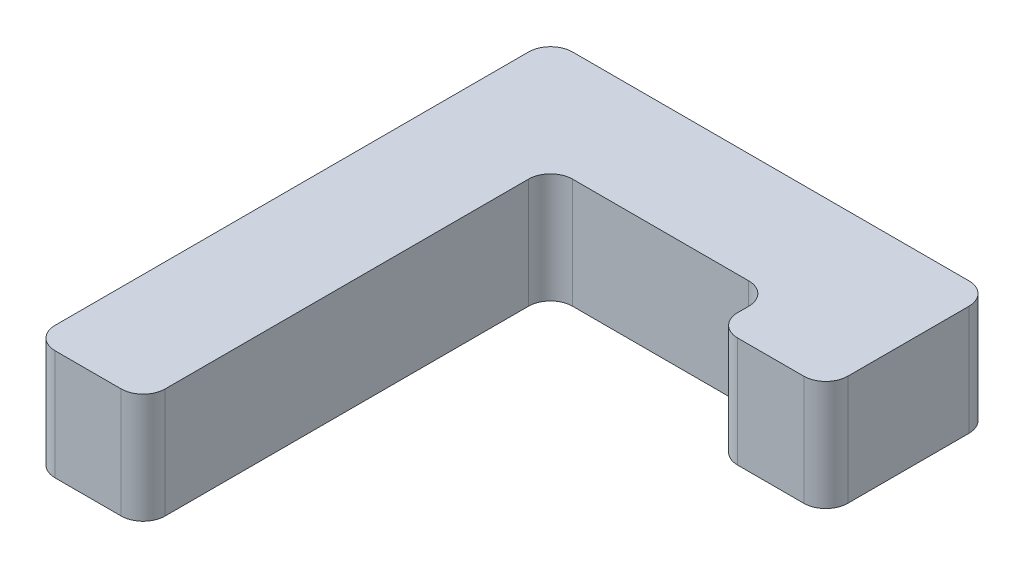
ISO-10303-21;
HEADER;
FILE_DESCRIPTION(('STEP AP214'),'2;1');
FILE_NAME('part.step','',(''),(''),'','','');
FILE_SCHEMA(('AUTOMOTIVE_DESIGN { 1 0 10303 214 1 1 1 1 }'));
ENDSEC;
DATA;
#1=APPLICATION_CONTEXT('core data for automotive mechanical design processes');
#2=APPLICATION_PROTOCOL_DEFINITION('international standard','automotive_design',2000,#1);
#3=PRODUCT_CONTEXT('',#1,'mechanical');
#4=PRODUCT('Part','Part','',(#3));
#5=PRODUCT_RELATED_PRODUCT_CATEGORY('part','',(#4));
#6=PRODUCT_DEFINITION_FORMATION('','',#4);
#7=PRODUCT_DEFINITION_CONTEXT('part definition',#1,'design');
#8=PRODUCT_DEFINITION('design','',#6,#7);
#9=PRODUCT_DEFINITION_SHAPE('','',#8);
#10=(LENGTH_UNIT() NAMED_UNIT(*) SI_UNIT(.MILLI.,.METRE.));
#11=(NAMED_UNIT(*) PLANE_ANGLE_UNIT() SI_UNIT($,.RADIAN.));
#12=(NAMED_UNIT(*) SI_UNIT($,.STERADIAN.) SOLID_ANGLE_UNIT());
#13=UNCERTAINTY_MEASURE_WITH_UNIT(LENGTH_MEASURE(1.E-05),#10,'distance_accuracy_value','');
#14=(GEOMETRIC_REPRESENTATION_CONTEXT(3) GLOBAL_UNCERTAINTY_ASSIGNED_CONTEXT((#13)) GLOBAL_UNIT_ASSIGNED_CONTEXT((#10,
#11,#12)) REPRESENTATION_CONTEXT('',''));
#15=CARTESIAN_POINT('',(0.,0.,0.));
#16=DIRECTION('',(0.,0.,1.));
#17=DIRECTION('',(1.,0.,0.));
#18=AXIS2_PLACEMENT_3D('',#15,#16,#17);
#19=CARTESIAN_POINT('',(12.7,12.7,0.));
#20=DIRECTION('',(0.,0.,-1.));
#21=DIRECTION('',(-1.,0.,0.));
#22=AXIS2_PLACEMENT_3D('',#19,#20,#21);
#23=PLANE('',#22);
#24=DIRECTION('',(1.,0.,0.));
#25=VECTOR('',#24,1.);
#26=CARTESIAN_POINT('',(12.7,0.,0.));
#27=LINE('',#26,#25);
#28=CARTESIAN_POINT('',(2.54,0.,0.));
#29=VERTEX_POINT('',#28);
#30=CARTESIAN_POINT('',(10.16,0.,0.));
#31=VERTEX_POINT('',#30);
#32=EDGE_CURVE('E257',#29,#31,#27,.T.);
#33=ORIENTED_EDGE('',*,*,#32,.T.);
#34=DIRECTION('',(0.,-1.,0.));
#35=VECTOR('',#34,1.);
#36=CARTESIAN_POINT('',(10.16,12.7,0.));
#37=LINE('',#36,#35);
#38=CARTESIAN_POINT('',(10.16,12.7,0.));
#39=VERTEX_POINT('',#38);
#40=EDGE_CURVE('E234',#31,#39,#37,.F.);
#41=ORIENTED_EDGE('',*,*,#40,.T.);
#42=DIRECTION('',(1.,0.,0.));
#43=VECTOR('',#42,1.);
#44=CARTESIAN_POINT('',(12.7,12.7,0.));
#45=LINE('',#44,#43);
#46=CARTESIAN_POINT('',(2.54,12.7,0.));
#47=VERTEX_POINT('',#46);
#48=EDGE_CURVE('E181',#47,#39,#45,.T.);
#49=ORIENTED_EDGE('',*,*,#48,.F.);
#50=DIRECTION('',(0.,-1.,0.));
#51=VECTOR('',#50,1.);
#52=CARTESIAN_POINT('',(2.54,12.7,0.));
#53=LINE('',#52,#51);
#54=EDGE_CURVE('E231',#47,#29,#53,.T.);
#55=ORIENTED_EDGE('',*,*,#54,.T.);
#56=EDGE_LOOP('',(#33,#41,#49,#55));
#57=FACE_BOUND('',#56,.T.);
#58=ADVANCED_FACE('F39',(#57),#23,.F.);
#59=CARTESIAN_POINT('',(12.7,12.7,-46.99));
#60=DIRECTION('',(-1.,0.,0.));
#61=DIRECTION('',(0.,0.,1.));
#62=AXIS2_PLACEMENT_3D('',#59,#60,#61);
#63=PLANE('',#62);
#64=DIRECTION('',(0.,0.,-1.));
#65=VECTOR('',#64,1.);
#66=CARTESIAN_POINT('',(12.7,12.7,-46.99));
#67=LINE('',#66,#65);
#68=CARTESIAN_POINT('',(12.7,12.7,-2.54));
#69=VERTEX_POINT('',#68);
#70=CARTESIAN_POINT('',(12.7,12.7,-44.45));
#71=VERTEX_POINT('',#70);
#72=EDGE_CURVE('E267',#69,#71,#67,.T.);
#73=ORIENTED_EDGE('',*,*,#72,.F.);
#74=DIRECTION('',(0.,-1.,0.));
#75=VECTOR('',#74,1.);
#76=CARTESIAN_POINT('',(12.7,12.7,-2.54));
#77=LINE('',#76,#75);
#78=CARTESIAN_POINT('',(12.7,0.,-2.54));
#79=VERTEX_POINT('',#78);
#80=EDGE_CURVE('E228',#69,#79,#77,.T.);
#81=ORIENTED_EDGE('',*,*,#80,.T.);
#82=DIRECTION('',(0.,0.,-1.));
#83=VECTOR('',#82,1.);
#84=CARTESIAN_POINT('',(12.7,0.,-46.99));
#85=LINE('',#84,#83);
#86=CARTESIAN_POINT('',(12.7,0.,-44.45));
#87=VERTEX_POINT('',#86);
#88=EDGE_CURVE('E246',#79,#87,#85,.T.);
#89=ORIENTED_EDGE('',*,*,#88,.T.);
#90=DIRECTION('',(0.,-1.,0.));
#91=VECTOR('',#90,1.);
#92=CARTESIAN_POINT('',(12.7,12.7,-44.45));
#93=LINE('',#92,#91);
#94=EDGE_CURVE('E226',#87,#71,#93,.F.);
#95=ORIENTED_EDGE('',*,*,#94,.T.);
#96=EDGE_LOOP('',(#73,#81,#89,#95));
#97=FACE_BOUND('',#96,.T.);
#98=ADVANCED_FACE('F254',(#97),#63,.F.);
#99=CARTESIAN_POINT('',(38.1,12.7,-46.99));
#100=DIRECTION('',(0.,0.,-1.));
#101=DIRECTION('',(-1.,0.,0.));
#102=AXIS2_PLACEMENT_3D('',#99,#100,#101);
#103=PLANE('',#102);
#104=DIRECTION('',(1.,0.,0.));
#105=VECTOR('',#104,1.);
#106=CARTESIAN_POINT('',(38.1,0.,-46.99));
#107=LINE('',#106,#105);
#108=CARTESIAN_POINT('',(15.24,0.,-46.99));
#109=VERTEX_POINT('',#108);
#110=CARTESIAN_POINT('',(35.56,0.,-46.99));
#111=VERTEX_POINT('',#110);
#112=EDGE_CURVE('E248',#109,#111,#107,.T.);
#113=ORIENTED_EDGE('',*,*,#112,.T.);
#114=DIRECTION('',(0.,-1.,0.));
#115=VECTOR('',#114,1.);
#116=CARTESIAN_POINT('',(35.56,12.7,-46.99));
#117=LINE('',#116,#115);
#118=CARTESIAN_POINT('',(35.56,12.7,-46.99));
#119=VERTEX_POINT('',#118);
#120=EDGE_CURVE('E219',#111,#119,#117,.F.);
#121=ORIENTED_EDGE('',*,*,#120,.T.);
#122=DIRECTION('',(1.,0.,0.));
#123=VECTOR('',#122,1.);
#124=CARTESIAN_POINT('',(38.1,12.7,-46.99));
#125=LINE('',#124,#123);
#126=CARTESIAN_POINT('',(15.24,12.7,-46.99));
#127=VERTEX_POINT('',#126);
#128=EDGE_CURVE('E265',#127,#119,#125,.T.);
#129=ORIENTED_EDGE('',*,*,#128,.F.);
#130=DIRECTION('',(0.,-1.,0.));
#131=VECTOR('',#130,1.);
#132=CARTESIAN_POINT('',(15.24,0.,-46.99));
#133=LINE('',#132,#131);
#134=EDGE_CURVE('E216',#127,#109,#133,.T.);
#135=ORIENTED_EDGE('',*,*,#134,.T.);
#136=EDGE_LOOP('',(#113,#121,#129,#135));
#137=FACE_BOUND('',#136,.T.);
#138=ADVANCED_FACE('F269',(#137),#103,.F.);
#139=CARTESIAN_POINT('',(38.1,12.7,-40.64));
#140=DIRECTION('',(1.,0.,0.));
#141=DIRECTION('',(0.,0.,-1.));
#142=AXIS2_PLACEMENT_3D('',#139,#140,#141);
#143=PLANE('',#142);
#144=DIRECTION('',(0.,0.,1.));
#145=VECTOR('',#144,1.);
#146=CARTESIAN_POINT('',(38.1,12.7,-40.64));
#147=LINE('',#146,#145);
#148=CARTESIAN_POINT('',(38.1,12.7,-44.45));
#149=VERTEX_POINT('',#148);
#150=CARTESIAN_POINT('',(38.1,12.7,-43.18));
#151=VERTEX_POINT('',#150);
#152=EDGE_CURVE('E271',#149,#151,#147,.T.);
#153=ORIENTED_EDGE('',*,*,#152,.F.);
#154=DIRECTION('',(0.,-1.,0.));
#155=VECTOR('',#154,1.);
#156=CARTESIAN_POINT('',(38.1,0.,-44.45));
#157=LINE('',#156,#155);
#158=CARTESIAN_POINT('',(38.1,0.,-44.45));
#159=VERTEX_POINT('',#158);
#160=EDGE_CURVE('E213',#149,#159,#157,.T.);
#161=ORIENTED_EDGE('',*,*,#160,.T.);
#162=DIRECTION('',(0.,0.,1.));
#163=VECTOR('',#162,1.);
#164=CARTESIAN_POINT('',(38.1,0.,-40.64));
#165=LINE('',#164,#163);
#166=CARTESIAN_POINT('',(38.1,0.,-43.18));
#167=VERTEX_POINT('',#166);
#168=EDGE_CURVE('E288',#159,#167,#165,.T.);
#169=ORIENTED_EDGE('',*,*,#168,.T.);
#170=DIRECTION('',(0.,-1.,0.));
#171=VECTOR('',#170,1.);
#172=CARTESIAN_POINT('',(38.1,12.7,-43.18));
#173=LINE('',#172,#171);
#174=EDGE_CURVE('E211',#167,#151,#173,.F.);
#175=ORIENTED_EDGE('',*,*,#174,.T.);
#176=EDGE_LOOP('',(#153,#161,#169,#175));
#177=FACE_BOUND('',#176,.T.);
#178=ADVANCED_FACE('F312',(#177),#143,.F.);
#179=CARTESIAN_POINT('',(50.8,12.7,-40.64));
#180=DIRECTION('',(0.,0.,-1.));
#181=DIRECTION('',(-1.,0.,0.));
#182=AXIS2_PLACEMENT_3D('',#179,#180,#181);
#183=PLANE('',#182);
#184=DIRECTION('',(1.,0.,0.));
#185=VECTOR('',#184,1.);
#186=CARTESIAN_POINT('',(50.8,0.,-40.64));
#187=LINE('',#186,#185);
#188=CARTESIAN_POINT('',(40.64,0.,-40.64));
#189=VERTEX_POINT('',#188);
#190=CARTESIAN_POINT('',(48.26,0.,-40.64));
#191=VERTEX_POINT('',#190);
#192=EDGE_CURVE('E183',#189,#191,#187,.T.);
#193=ORIENTED_EDGE('',*,*,#192,.T.);
#194=DIRECTION('',(0.,-1.,0.));
#195=VECTOR('',#194,1.);
#196=CARTESIAN_POINT('',(48.26,12.7,-40.64));
#197=LINE('',#196,#195);
#198=CARTESIAN_POINT('',(48.26,12.7,-40.64));
#199=VERTEX_POINT('',#198);
#200=EDGE_CURVE('E224',#191,#199,#197,.F.);
#201=ORIENTED_EDGE('',*,*,#200,.T.);
#202=DIRECTION('',(1.,0.,0.));
#203=VECTOR('',#202,1.);
#204=CARTESIAN_POINT('',(50.8,12.7,-40.64));
#205=LINE('',#204,#203);
#206=CARTESIAN_POINT('',(40.64,12.7,-40.64));
#207=VERTEX_POINT('',#206);
#208=EDGE_CURVE('E274',#207,#199,#205,.T.);
#209=ORIENTED_EDGE('',*,*,#208,.F.);
#210=DIRECTION('',(0.,-1.,0.));
#211=VECTOR('',#210,1.);
#212=CARTESIAN_POINT('',(40.64,12.7,-40.64));
#213=LINE('',#212,#211);
#214=EDGE_CURVE('E221',#207,#189,#213,.T.);
#215=ORIENTED_EDGE('',*,*,#214,.T.);
#216=EDGE_LOOP('',(#193,#201,#209,#215));
#217=FACE_BOUND('',#216,.T.);
#218=ADVANCED_FACE('F294',(#217),#183,.F.);
#219=CARTESIAN_POINT('',(50.8,12.7,-59.69));
#220=DIRECTION('',(-1.,0.,0.));
#221=DIRECTION('',(0.,0.,1.));
#222=AXIS2_PLACEMENT_3D('',#219,#220,#221);
#223=PLANE('',#222);
#224=DIRECTION('',(0.,0.,-1.));
#225=VECTOR('',#224,1.);
#226=CARTESIAN_POINT('',(50.8,0.,-59.69));
#227=LINE('',#226,#225);
#228=CARTESIAN_POINT('',(50.8,0.,-43.18));
#229=VERTEX_POINT('',#228);
#230=CARTESIAN_POINT('',(50.8,0.,-57.15));
#231=VERTEX_POINT('',#230);
#232=EDGE_CURVE('E179',#229,#231,#227,.T.);
#233=ORIENTED_EDGE('',*,*,#232,.T.);
#234=DIRECTION('',(0.,-1.,0.));
#235=VECTOR('',#234,1.);
#236=CARTESIAN_POINT('',(50.8,12.7,-57.15));
#237=LINE('',#236,#235);
#238=CARTESIAN_POINT('',(50.8,12.7,-57.15));
#239=VERTEX_POINT('',#238);
#240=EDGE_CURVE('E158',#231,#239,#237,.F.);
#241=ORIENTED_EDGE('',*,*,#240,.T.);
#242=DIRECTION('',(0.,0.,-1.));
#243=VECTOR('',#242,1.);
#244=CARTESIAN_POINT('',(50.8,12.7,-59.69));
#245=LINE('',#244,#243);
#246=CARTESIAN_POINT('',(50.8,12.7,-43.18));
#247=VERTEX_POINT('',#246);
#248=EDGE_CURVE('E281',#247,#239,#245,.T.);
#249=ORIENTED_EDGE('',*,*,#248,.F.);
#250=DIRECTION('',(0.,-1.,0.));
#251=VECTOR('',#250,1.);
#252=CARTESIAN_POINT('',(50.8,12.7,-43.18));
#253=LINE('',#252,#251);
#254=EDGE_CURVE('E163',#247,#229,#253,.T.);
#255=ORIENTED_EDGE('',*,*,#254,.T.);
#256=EDGE_LOOP('',(#233,#241,#249,#255));
#257=FACE_BOUND('',#256,.T.);
#258=ADVANCED_FACE('F303',(#257),#223,.F.);
#259=CARTESIAN_POINT('',(0.,12.7,-59.69));
#260=DIRECTION('',(0.,0.,1.));
#261=DIRECTION('',(1.,0.,0.));
#262=AXIS2_PLACEMENT_3D('',#259,#260,#261);
#263=PLANE('',#262);
#264=DIRECTION('',(-1.,0.,0.));
#265=VECTOR('',#264,1.);
#266=CARTESIAN_POINT('',(0.,12.7,-59.69));
#267=LINE('',#266,#265);
#268=CARTESIAN_POINT('',(48.26,12.7,-59.69));
#269=VERTEX_POINT('',#268);
#270=CARTESIAN_POINT('',(2.54,12.7,-59.69));
#271=VERTEX_POINT('',#270);
#272=EDGE_CURVE('E172',#269,#271,#267,.T.);
#273=ORIENTED_EDGE('',*,*,#272,.F.);
#274=DIRECTION('',(0.,-1.,0.));
#275=VECTOR('',#274,1.);
#276=CARTESIAN_POINT('',(48.26,12.7,-59.69));
#277=LINE('',#276,#275);
#278=CARTESIAN_POINT('',(48.26,0.,-59.69));
#279=VERTEX_POINT('',#278);
#280=EDGE_CURVE('E157',#269,#279,#277,.T.);
#281=ORIENTED_EDGE('',*,*,#280,.T.);
#282=DIRECTION('',(-1.,0.,0.));
#283=VECTOR('',#282,1.);
#284=CARTESIAN_POINT('',(0.,0.,-59.69));
#285=LINE('',#284,#283);
#286=CARTESIAN_POINT('',(2.54,0.,-59.69));
#287=VERTEX_POINT('',#286);
#288=EDGE_CURVE('E170',#279,#287,#285,.T.);
#289=ORIENTED_EDGE('',*,*,#288,.T.);
#290=DIRECTION('',(0.,-1.,0.));
#291=VECTOR('',#290,1.);
#292=CARTESIAN_POINT('',(2.54,12.7,-59.69));
#293=LINE('',#292,#291);
#294=EDGE_CURVE('E174',#287,#271,#293,.F.);
#295=ORIENTED_EDGE('',*,*,#294,.T.);
#296=EDGE_LOOP('',(#273,#281,#289,#295));
#297=FACE_BOUND('',#296,.T.);
#298=ADVANCED_FACE('F169',(#297),#263,.F.);
#299=CARTESIAN_POINT('',(0.,12.7,0.));
#300=DIRECTION('',(1.,0.,0.));
#301=DIRECTION('',(0.,0.,-1.));
#302=AXIS2_PLACEMENT_3D('',#299,#300,#301);
#303=PLANE('',#302);
#304=DIRECTION('',(0.,0.,1.));
#305=VECTOR('',#304,1.);
#306=CARTESIAN_POINT('',(0.,0.,0.));
#307=LINE('',#306,#305);
#308=CARTESIAN_POINT('',(0.,0.,-57.15));
#309=VERTEX_POINT('',#308);
#310=CARTESIAN_POINT('',(0.,0.,-2.54));
#311=VERTEX_POINT('',#310);
#312=EDGE_CURVE('E178',#309,#311,#307,.T.);
#313=ORIENTED_EDGE('',*,*,#312,.T.);
#314=DIRECTION('',(0.,-1.,0.));
#315=VECTOR('',#314,1.);
#316=CARTESIAN_POINT('',(0.,12.7,-2.54));
#317=LINE('',#316,#315);
#318=CARTESIAN_POINT('',(0.,12.7,-2.54));
#319=VERTEX_POINT('',#318);
#320=EDGE_CURVE('E54',#311,#319,#317,.F.);
#321=ORIENTED_EDGE('',*,*,#320,.T.);
#322=DIRECTION('',(0.,0.,1.));
#323=VECTOR('',#322,1.);
#324=CARTESIAN_POINT('',(0.,12.7,0.));
#325=LINE('',#324,#323);
#326=CARTESIAN_POINT('',(0.,12.7,-57.15));
#327=VERTEX_POINT('',#326);
#328=EDGE_CURVE('E187',#327,#319,#325,.T.);
#329=ORIENTED_EDGE('',*,*,#328,.F.);
#330=DIRECTION('',(0.,-1.,0.));
#331=VECTOR('',#330,1.);
#332=CARTESIAN_POINT('',(0.,12.7,-57.15));
#333=LINE('',#332,#331);
#334=EDGE_CURVE('E236',#327,#309,#333,.T.);
#335=ORIENTED_EDGE('',*,*,#334,.T.);
#336=EDGE_LOOP('',(#313,#321,#329,#335));
#337=FACE_BOUND('',#336,.T.);
#338=ADVANCED_FACE('F310',(#337),#303,.F.);
#339=CARTESIAN_POINT('',(0.,12.7,0.));
#340=DIRECTION('',(0.,-1.,0.));
#341=DIRECTION('',(0.,0.,-1.));
#342=AXIS2_PLACEMENT_3D('',#339,#340,#341);
#343=PLANE('',#342);
#344=ORIENTED_EDGE('',*,*,#248,.T.);
#345=CARTESIAN_POINT('',(48.26,12.7,-57.15));
#346=DIRECTION('',(0.,-1.,0.));
#347=DIRECTION('',(0.,0.,-1.));
#348=AXIS2_PLACEMENT_3D('',#345,#346,#347);
#349=CIRCLE('',#348,2.54);
#350=EDGE_CURVE('E209',#239,#269,#349,.F.);
#351=ORIENTED_EDGE('',*,*,#350,.T.);
#352=ORIENTED_EDGE('',*,*,#272,.T.);
#353=CARTESIAN_POINT('',(2.54,12.7,-57.15));
#354=DIRECTION('',(0.,-1.,0.));
#355=DIRECTION('',(0.,0.,-1.));
#356=AXIS2_PLACEMENT_3D('',#353,#354,#355);
#357=CIRCLE('',#356,2.54);
#358=EDGE_CURVE('E61',#271,#327,#357,.F.);
#359=ORIENTED_EDGE('',*,*,#358,.T.);
#360=ORIENTED_EDGE('',*,*,#328,.T.);
#361=CARTESIAN_POINT('',(2.54,12.7,-2.54));
#362=DIRECTION('',(0.,-1.,0.));
#363=DIRECTION('',(0.,0.,-1.));
#364=AXIS2_PLACEMENT_3D('',#361,#362,#363);
#365=CIRCLE('',#364,2.54);
#366=EDGE_CURVE('E201',#319,#47,#365,.F.);
#367=ORIENTED_EDGE('',*,*,#366,.T.);
#368=ORIENTED_EDGE('',*,*,#48,.T.);
#369=CARTESIAN_POINT('',(10.16,12.7,-2.54));
#370=DIRECTION('',(0.,-1.,0.));
#371=DIRECTION('',(0.,0.,-1.));
#372=AXIS2_PLACEMENT_3D('',#369,#370,#371);
#373=CIRCLE('',#372,2.54);
#374=EDGE_CURVE('E203',#39,#69,#373,.F.);
#375=ORIENTED_EDGE('',*,*,#374,.T.);
#376=ORIENTED_EDGE('',*,*,#72,.T.);
#377=CARTESIAN_POINT('',(15.24,12.7,-44.45));
#378=DIRECTION('',(0.,-1.,0.));
#379=DIRECTION('',(0.,0.,-1.));
#380=AXIS2_PLACEMENT_3D('',#377,#378,#379);
#381=CIRCLE('',#380,2.54);
#382=EDGE_CURVE('E11',#71,#127,#381,.T.);
#383=ORIENTED_EDGE('',*,*,#382,.T.);
#384=ORIENTED_EDGE('',*,*,#128,.T.);
#385=CARTESIAN_POINT('',(35.56,12.7,-44.45));
#386=DIRECTION('',(0.,-1.,0.));
#387=DIRECTION('',(0.,0.,-1.));
#388=AXIS2_PLACEMENT_3D('',#385,#386,#387);
#389=CIRCLE('',#388,2.54);
#390=EDGE_CURVE('E242',#119,#149,#389,.T.);
#391=ORIENTED_EDGE('',*,*,#390,.T.);
#392=ORIENTED_EDGE('',*,*,#152,.T.);
#393=CARTESIAN_POINT('',(40.64,12.7,-43.18));
#394=DIRECTION('',(0.,-1.,0.));
#395=DIRECTION('',(0.,0.,-1.));
#396=AXIS2_PLACEMENT_3D('',#393,#394,#395);
#397=CIRCLE('',#396,2.54);
#398=EDGE_CURVE('E205',#151,#207,#397,.F.);
#399=ORIENTED_EDGE('',*,*,#398,.T.);
#400=ORIENTED_EDGE('',*,*,#208,.T.);
#401=CARTESIAN_POINT('',(48.26,12.7,-43.18));
#402=DIRECTION('',(0.,-1.,0.));
#403=DIRECTION('',(0.,0.,-1.));
#404=AXIS2_PLACEMENT_3D('',#401,#402,#403);
#405=CIRCLE('',#404,2.54);
#406=EDGE_CURVE('E207',#199,#247,#405,.F.);
#407=ORIENTED_EDGE('',*,*,#406,.T.);
#408=EDGE_LOOP('',(#344,#351,#352,#359,#360,#367,#368,#375,#376,#383,#384,#391,#392,#399,#400,#407));
#409=FACE_BOUND('',#408,.T.);
#410=ADVANCED_FACE('F264',(#409),#343,.F.);
#411=CARTESIAN_POINT('',(0.,0.,0.));
#412=DIRECTION('',(0.,-1.,0.));
#413=DIRECTION('',(0.,0.,-1.));
#414=AXIS2_PLACEMENT_3D('',#411,#412,#413);
#415=PLANE('',#414);
#416=ORIENTED_EDGE('',*,*,#288,.F.);
#417=CARTESIAN_POINT('',(48.26,0.,-57.15));
#418=DIRECTION('',(0.,-1.,0.));
#419=DIRECTION('',(0.,0.,-1.));
#420=AXIS2_PLACEMENT_3D('',#417,#418,#419);
#421=CIRCLE('',#420,2.54);
#422=EDGE_CURVE('E153',#279,#231,#421,.T.);
#423=ORIENTED_EDGE('',*,*,#422,.T.);
#424=ORIENTED_EDGE('',*,*,#232,.F.);
#425=CARTESIAN_POINT('',(48.26,0.,-43.18));
#426=DIRECTION('',(0.,-1.,0.));
#427=DIRECTION('',(0.,0.,-1.));
#428=AXIS2_PLACEMENT_3D('',#425,#426,#427);
#429=CIRCLE('',#428,2.54);
#430=EDGE_CURVE('E164',#229,#191,#429,.T.);
#431=ORIENTED_EDGE('',*,*,#430,.T.);
#432=ORIENTED_EDGE('',*,*,#192,.F.);
#433=CARTESIAN_POINT('',(40.64,0.,-43.18));
#434=DIRECTION('',(0.,-1.,0.));
#435=DIRECTION('',(0.,0.,-1.));
#436=AXIS2_PLACEMENT_3D('',#433,#434,#435);
#437=CIRCLE('',#436,2.54);
#438=EDGE_CURVE('E194',#189,#167,#437,.T.);
#439=ORIENTED_EDGE('',*,*,#438,.T.);
#440=ORIENTED_EDGE('',*,*,#168,.F.);
#441=CARTESIAN_POINT('',(35.56,0.,-44.45));
#442=DIRECTION('',(0.,-1.,0.));
#443=DIRECTION('',(0.,0.,-1.));
#444=AXIS2_PLACEMENT_3D('',#441,#442,#443);
#445=CIRCLE('',#444,2.54);
#446=EDGE_CURVE('E240',#159,#111,#445,.F.);
#447=ORIENTED_EDGE('',*,*,#446,.T.);
#448=ORIENTED_EDGE('',*,*,#112,.F.);
#449=CARTESIAN_POINT('',(15.24,0.,-44.45));
#450=DIRECTION('',(0.,-1.,0.));
#451=DIRECTION('',(0.,0.,-1.));
#452=AXIS2_PLACEMENT_3D('',#449,#450,#451);
#453=CIRCLE('',#452,2.54);
#454=EDGE_CURVE('E47',#109,#87,#453,.F.);
#455=ORIENTED_EDGE('',*,*,#454,.T.);
#456=ORIENTED_EDGE('',*,*,#88,.F.);
#457=CARTESIAN_POINT('',(10.16,0.,-2.54));
#458=DIRECTION('',(0.,-1.,0.));
#459=DIRECTION('',(0.,0.,-1.));
#460=AXIS2_PLACEMENT_3D('',#457,#458,#459);
#461=CIRCLE('',#460,2.54);
#462=EDGE_CURVE('E192',#79,#31,#461,.T.);
#463=ORIENTED_EDGE('',*,*,#462,.T.);
#464=ORIENTED_EDGE('',*,*,#32,.F.);
#465=CARTESIAN_POINT('',(2.54,0.,-2.54));
#466=DIRECTION('',(0.,-1.,0.));
#467=DIRECTION('',(0.,0.,-1.));
#468=AXIS2_PLACEMENT_3D('',#465,#466,#467);
#469=CIRCLE('',#468,2.54);
#470=EDGE_CURVE('E190',#29,#311,#469,.T.);
#471=ORIENTED_EDGE('',*,*,#470,.T.);
#472=ORIENTED_EDGE('',*,*,#312,.F.);
#473=CARTESIAN_POINT('',(2.54,0.,-57.15));
#474=DIRECTION('',(0.,-1.,0.));
#475=DIRECTION('',(0.,0.,-1.));
#476=AXIS2_PLACEMENT_3D('',#473,#474,#475);
#477=CIRCLE('',#476,2.54);
#478=EDGE_CURVE('E173',#309,#287,#477,.T.);
#479=ORIENTED_EDGE('',*,*,#478,.T.);
#480=EDGE_LOOP('',(#416,#423,#424,#431,#432,#439,#440,#447,#448,#455,#456,#463,#464,#471,#472,#479));
#481=FACE_BOUND('',#480,.T.);
#482=ADVANCED_FACE('F176',(#481),#415,.T.);
#483=CARTESIAN_POINT('',(48.26,12.7,-57.15));
#484=DIRECTION('',(0.,-1.,0.));
#485=DIRECTION('',(0.,0.,-1.));
#486=AXIS2_PLACEMENT_3D('',#483,#484,#485);
#487=CYLINDRICAL_SURFACE('',#486,2.54);
#488=ORIENTED_EDGE('',*,*,#350,.F.);
#489=ORIENTED_EDGE('',*,*,#240,.F.);
#490=ORIENTED_EDGE('',*,*,#422,.F.);
#491=ORIENTED_EDGE('',*,*,#280,.F.);
#492=EDGE_LOOP('',(#488,#489,#490,#491));
#493=FACE_BOUND('',#492,.T.);
#494=ADVANCED_FACE('F156',(#493),#487,.T.);
#495=CARTESIAN_POINT('',(35.56,12.7,-44.45));
#496=DIRECTION('',(0.,1.,0.));
#497=DIRECTION('',(0.,0.,1.));
#498=AXIS2_PLACEMENT_3D('',#495,#496,#497);
#499=CYLINDRICAL_SURFACE('',#498,2.54);
#500=ORIENTED_EDGE('',*,*,#390,.F.);
#501=ORIENTED_EDGE('',*,*,#120,.F.);
#502=ORIENTED_EDGE('',*,*,#446,.F.);
#503=ORIENTED_EDGE('',*,*,#160,.F.);
#504=EDGE_LOOP('',(#500,#501,#502,#503));
#505=FACE_BOUND('',#504,.T.);
#506=ADVANCED_FACE('F325',(#505),#499,.F.);
#507=CARTESIAN_POINT('',(48.26,12.7,-43.18));
#508=DIRECTION('',(0.,-1.,0.));
#509=DIRECTION('',(0.,0.,-1.));
#510=AXIS2_PLACEMENT_3D('',#507,#508,#509);
#511=CYLINDRICAL_SURFACE('',#510,2.54);
#512=ORIENTED_EDGE('',*,*,#406,.F.);
#513=ORIENTED_EDGE('',*,*,#200,.F.);
#514=ORIENTED_EDGE('',*,*,#430,.F.);
#515=ORIENTED_EDGE('',*,*,#254,.F.);
#516=EDGE_LOOP('',(#512,#513,#514,#515));
#517=FACE_BOUND('',#516,.T.);
#518=ADVANCED_FACE('F299',(#517),#511,.T.);
#519=CARTESIAN_POINT('',(40.64,12.7,-43.18));
#520=DIRECTION('',(0.,-1.,0.));
#521=DIRECTION('',(0.,0.,-1.));
#522=AXIS2_PLACEMENT_3D('',#519,#520,#521);
#523=CYLINDRICAL_SURFACE('',#522,2.54);
#524=ORIENTED_EDGE('',*,*,#398,.F.);
#525=ORIENTED_EDGE('',*,*,#174,.F.);
#526=ORIENTED_EDGE('',*,*,#438,.F.);
#527=ORIENTED_EDGE('',*,*,#214,.F.);
#528=EDGE_LOOP('',(#524,#525,#526,#527));
#529=FACE_BOUND('',#528,.T.);
#530=ADVANCED_FACE('F331',(#529),#523,.T.);
#531=CARTESIAN_POINT('',(10.16,12.7,-2.54));
#532=DIRECTION('',(0.,-1.,0.));
#533=DIRECTION('',(0.,0.,-1.));
#534=AXIS2_PLACEMENT_3D('',#531,#532,#533);
#535=CYLINDRICAL_SURFACE('',#534,2.54);
#536=ORIENTED_EDGE('',*,*,#374,.F.);
#537=ORIENTED_EDGE('',*,*,#40,.F.);
#538=ORIENTED_EDGE('',*,*,#462,.F.);
#539=ORIENTED_EDGE('',*,*,#80,.F.);
#540=EDGE_LOOP('',(#536,#537,#538,#539));
#541=FACE_BOUND('',#540,.T.);
#542=ADVANCED_FACE('F334',(#541),#535,.T.);
#543=CARTESIAN_POINT('',(2.54,12.7,-2.54));
#544=DIRECTION('',(0.,-1.,0.));
#545=DIRECTION('',(0.,0.,-1.));
#546=AXIS2_PLACEMENT_3D('',#543,#544,#545);
#547=CYLINDRICAL_SURFACE('',#546,2.54);
#548=ORIENTED_EDGE('',*,*,#366,.F.);
#549=ORIENTED_EDGE('',*,*,#320,.F.);
#550=ORIENTED_EDGE('',*,*,#470,.F.);
#551=ORIENTED_EDGE('',*,*,#54,.F.);
#552=EDGE_LOOP('',(#548,#549,#550,#551));
#553=FACE_BOUND('',#552,.T.);
#554=ADVANCED_FACE('F338',(#553),#547,.T.);
#555=CARTESIAN_POINT('',(15.24,12.7,-44.45));
#556=DIRECTION('',(0.,1.,0.));
#557=DIRECTION('',(0.,0.,1.));
#558=AXIS2_PLACEMENT_3D('',#555,#556,#557);
#559=CYLINDRICAL_SURFACE('',#558,2.54);
#560=ORIENTED_EDGE('',*,*,#382,.F.);
#561=ORIENTED_EDGE('',*,*,#94,.F.);
#562=ORIENTED_EDGE('',*,*,#454,.F.);
#563=ORIENTED_EDGE('',*,*,#134,.F.);
#564=EDGE_LOOP('',(#560,#561,#562,#563));
#565=FACE_BOUND('',#564,.T.);
#566=ADVANCED_FACE('F260',(#565),#559,.F.);
#567=CARTESIAN_POINT('',(2.54,12.7,-57.15));
#568=DIRECTION('',(0.,-1.,0.));
#569=DIRECTION('',(0.,0.,-1.));
#570=AXIS2_PLACEMENT_3D('',#567,#568,#569);
#571=CYLINDRICAL_SURFACE('',#570,2.54);
#572=ORIENTED_EDGE('',*,*,#358,.F.);
#573=ORIENTED_EDGE('',*,*,#294,.F.);
#574=ORIENTED_EDGE('',*,*,#478,.F.);
#575=ORIENTED_EDGE('',*,*,#334,.F.);
#576=EDGE_LOOP('',(#572,#573,#574,#575));
#577=FACE_BOUND('',#576,.T.);
#578=ADVANCED_FACE('F41',(#577),#571,.T.);
#579=CLOSED_SHELL('',(#58,#98,#138,#178,#218,#258,#298,#338,#410,#482,#494,#506,#518,#530,#542,
#554,#566,#578));
#580=MANIFOLD_SOLID_BREP('B2',#579);
#581=ADVANCED_BREP_SHAPE_REPRESENTATION('',(#18,#580),#14);
#582=SHAPE_DEFINITION_REPRESENTATION(#9,#581);
ENDSEC;
END-ISO-10303-21;
